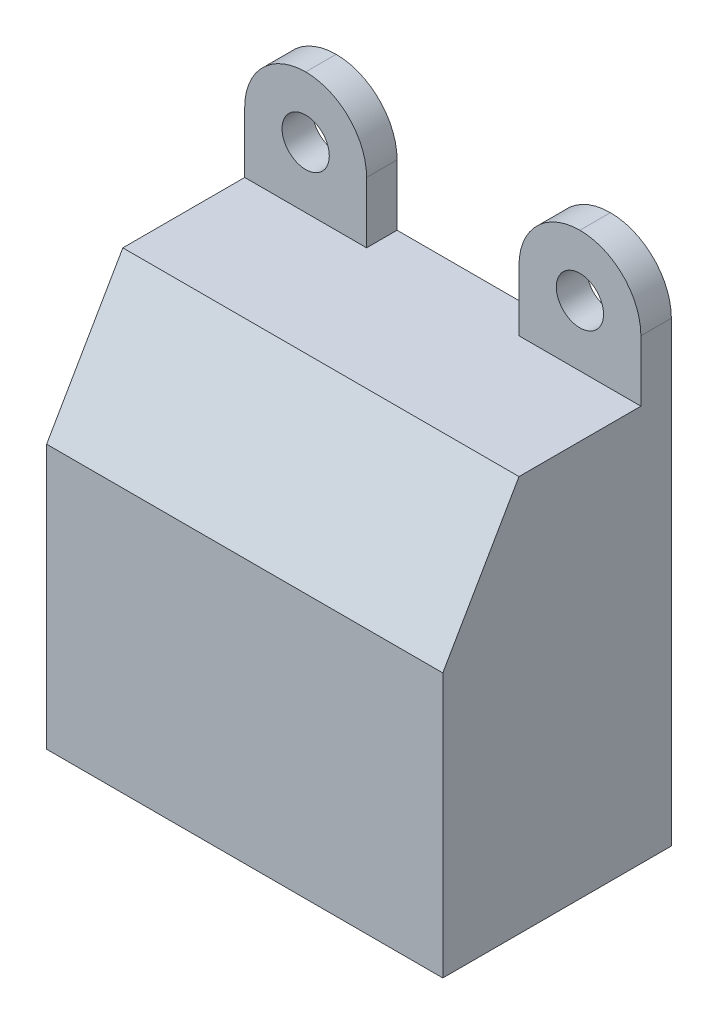
ISO-10303-21;
HEADER;
FILE_DESCRIPTION(('STEP AP214'),'2;1');
FILE_NAME('part.step','',(''),(''),'','','');
FILE_SCHEMA(('AUTOMOTIVE_DESIGN { 1 0 10303 214 1 1 1 1 }'));
ENDSEC;
DATA;
#1=APPLICATION_CONTEXT('core data for automotive mechanical design processes');
#2=APPLICATION_PROTOCOL_DEFINITION('international standard','automotive_design',2000,#1);
#3=PRODUCT_CONTEXT('',#1,'mechanical');
#4=PRODUCT('Part','Part','',(#3));
#5=PRODUCT_RELATED_PRODUCT_CATEGORY('part','',(#4));
#6=PRODUCT_DEFINITION_FORMATION('','',#4);
#7=PRODUCT_DEFINITION_CONTEXT('part definition',#1,'design');
#8=PRODUCT_DEFINITION('design','',#6,#7);
#9=PRODUCT_DEFINITION_SHAPE('','',#8);
#10=(LENGTH_UNIT() NAMED_UNIT(*) SI_UNIT(.MILLI.,.METRE.));
#11=(NAMED_UNIT(*) PLANE_ANGLE_UNIT() SI_UNIT($,.RADIAN.));
#12=(NAMED_UNIT(*) SI_UNIT($,.STERADIAN.) SOLID_ANGLE_UNIT());
#13=UNCERTAINTY_MEASURE_WITH_UNIT(LENGTH_MEASURE(1.E-05),#10,'distance_accuracy_value','');
#14=(GEOMETRIC_REPRESENTATION_CONTEXT(3) GLOBAL_UNCERTAINTY_ASSIGNED_CONTEXT((#13)) GLOBAL_UNIT_ASSIGNED_CONTEXT((#10,
#11,#12)) REPRESENTATION_CONTEXT('',''));
#15=CARTESIAN_POINT('',(0.,0.,0.));
#16=DIRECTION('',(0.,0.,1.));
#17=DIRECTION('',(1.,0.,0.));
#18=AXIS2_PLACEMENT_3D('',#15,#16,#17);
#19=CARTESIAN_POINT('',(70.,26.,15.));
#20=DIRECTION('',(0.,-1.,0.));
#21=DIRECTION('',(1.,0.,0.));
#22=AXIS2_PLACEMENT_3D('',#19,#20,#21);
#23=PLANE('',#22);
#24=DIRECTION('',(0.,0.,1.));
#25=VECTOR('',#24,1.);
#26=CARTESIAN_POINT('',(62.,26.,0.));
#27=LINE('',#26,#25);
#28=CARTESIAN_POINT('',(62.,26.,0.));
#29=VERTEX_POINT('',#28);
#30=CARTESIAN_POINT('',(62.,26.,2.));
#31=VERTEX_POINT('',#30);
#32=EDGE_CURVE('E134',#29,#31,#27,.T.);
#33=ORIENTED_EDGE('',*,*,#32,.F.);
#34=DIRECTION('',(-1.,0.,0.));
#35=VECTOR('',#34,1.);
#36=CARTESIAN_POINT('',(70.,26.,0.));
#37=LINE('',#36,#35);
#38=CARTESIAN_POINT('',(52.,26.,0.));
#39=VERTEX_POINT('',#38);
#40=EDGE_CURVE('E142',#29,#39,#37,.T.);
#41=ORIENTED_EDGE('',*,*,#40,.T.);
#42=DIRECTION('',(0.,0.,-1.));
#43=VECTOR('',#42,1.);
#44=CARTESIAN_POINT('',(52.,26.,0.));
#45=LINE('',#44,#43);
#46=CARTESIAN_POINT('',(52.,26.,2.));
#47=VERTEX_POINT('',#46);
#48=EDGE_CURVE('E172',#47,#39,#45,.T.);
#49=ORIENTED_EDGE('',*,*,#48,.F.);
#50=DIRECTION('',(1.,0.,0.));
#51=VECTOR('',#50,1.);
#52=CARTESIAN_POINT('',(44.,26.,2.));
#53=LINE('',#52,#51);
#54=CARTESIAN_POINT('',(44.,26.,2.));
#55=VERTEX_POINT('',#54);
#56=EDGE_CURVE('E138',#55,#47,#53,.T.);
#57=ORIENTED_EDGE('',*,*,#56,.F.);
#58=DIRECTION('',(0.,0.,-1.));
#59=VECTOR('',#58,1.);
#60=CARTESIAN_POINT('',(44.,26.,15.));
#61=LINE('',#60,#59);
#62=CARTESIAN_POINT('',(44.,26.,9.99999999999999));
#63=VERTEX_POINT('',#62);
#64=EDGE_CURVE('E223',#63,#55,#61,.T.);
#65=ORIENTED_EDGE('',*,*,#64,.F.);
#66=DIRECTION('',(1.,0.,0.));
#67=VECTOR('',#66,1.);
#68=CARTESIAN_POINT('',(70.,26.,9.99999999999999));
#69=LINE('',#68,#67);
#70=CARTESIAN_POINT('',(70.,26.,9.99999999999999));
#71=VERTEX_POINT('',#70);
#72=EDGE_CURVE('E245',#63,#71,#69,.T.);
#73=ORIENTED_EDGE('',*,*,#72,.T.);
#74=DIRECTION('',(0.,0.,-1.));
#75=VECTOR('',#74,1.);
#76=CARTESIAN_POINT('',(70.,26.,15.));
#77=LINE('',#76,#75);
#78=CARTESIAN_POINT('',(70.,26.,2.));
#79=VERTEX_POINT('',#78);
#80=EDGE_CURVE('E226',#71,#79,#77,.T.);
#81=ORIENTED_EDGE('',*,*,#80,.T.);
#82=DIRECTION('',(1.,0.,0.));
#83=VECTOR('',#82,1.);
#84=CARTESIAN_POINT('',(70.,26.,2.));
#85=LINE('',#84,#83);
#86=EDGE_CURVE('E155',#31,#79,#85,.T.);
#87=ORIENTED_EDGE('',*,*,#86,.F.);
#88=EDGE_LOOP('',(#33,#41,#49,#57,#65,#73,#81,#87));
#89=FACE_BOUND('',#88,.T.);
#90=ADVANCED_FACE('F32',(#89),#23,.F.);
#91=CARTESIAN_POINT('',(70.,0.,15.));
#92=DIRECTION('',(-1.,0.,0.));
#93=DIRECTION('',(0.,0.,1.));
#94=AXIS2_PLACEMENT_3D('',#91,#92,#93);
#95=PLANE('',#94);
#96=DIRECTION('',(0.,1.,0.));
#97=VECTOR('',#96,1.);
#98=CARTESIAN_POINT('',(70.,0.,0.));
#99=LINE('',#98,#97);
#100=CARTESIAN_POINT('',(70.,0.,0.));
#101=VERTEX_POINT('',#100);
#102=CARTESIAN_POINT('',(70.,30.,0.));
#103=VERTEX_POINT('',#102);
#104=EDGE_CURVE('E150',#101,#103,#99,.T.);
#105=ORIENTED_EDGE('',*,*,#104,.T.);
#106=DIRECTION('',(0.,0.,-1.));
#107=VECTOR('',#106,1.);
#108=CARTESIAN_POINT('',(70.,30.,15.));
#109=LINE('',#108,#107);
#110=CARTESIAN_POINT('',(70.,30.,2.));
#111=VERTEX_POINT('',#110);
#112=EDGE_CURVE('E192',#103,#111,#109,.F.);
#113=ORIENTED_EDGE('',*,*,#112,.T.);
#114=DIRECTION('',(0.,-1.,0.));
#115=VECTOR('',#114,1.);
#116=CARTESIAN_POINT('',(70.,34.,2.));
#117=LINE('',#116,#115);
#118=EDGE_CURVE('E158',#111,#79,#117,.T.);
#119=ORIENTED_EDGE('',*,*,#118,.T.);
#120=ORIENTED_EDGE('',*,*,#80,.F.);
#121=DIRECTION('',(0.,-0.866025403784438,0.500000000000001));
#122=VECTOR('',#121,1.);
#123=CARTESIAN_POINT('',(70.,17.3397459621556,15.));
#124=LINE('',#123,#122);
#125=CARTESIAN_POINT('',(70.,17.3397459621556,15.));
#126=VERTEX_POINT('',#125);
#127=EDGE_CURVE('E231',#71,#126,#124,.T.);
#128=ORIENTED_EDGE('',*,*,#127,.T.);
#129=DIRECTION('',(0.,1.,0.));
#130=VECTOR('',#129,1.);
#131=CARTESIAN_POINT('',(70.,0.,15.));
#132=LINE('',#131,#130);
#133=CARTESIAN_POINT('',(70.,0.,15.));
#134=VERTEX_POINT('',#133);
#135=EDGE_CURVE('E212',#134,#126,#132,.T.);
#136=ORIENTED_EDGE('',*,*,#135,.F.);
#137=DIRECTION('',(0.,0.,-1.));
#138=VECTOR('',#137,1.);
#139=CARTESIAN_POINT('',(70.,0.,15.));
#140=LINE('',#139,#138);
#141=EDGE_CURVE('E217',#134,#101,#140,.T.);
#142=ORIENTED_EDGE('',*,*,#141,.T.);
#143=EDGE_LOOP('',(#105,#113,#119,#120,#128,#136,#142));
#144=FACE_BOUND('',#143,.T.);
#145=ADVANCED_FACE('F265',(#144),#95,.F.);
#146=CARTESIAN_POINT('',(44.,0.,15.));
#147=DIRECTION('',(1.,0.,0.));
#148=DIRECTION('',(0.,0.,-1.));
#149=AXIS2_PLACEMENT_3D('',#146,#147,#148);
#150=PLANE('',#149);
#151=DIRECTION('',(0.,-1.,0.));
#152=VECTOR('',#151,1.);
#153=CARTESIAN_POINT('',(44.,34.,2.));
#154=LINE('',#153,#152);
#155=CARTESIAN_POINT('',(44.,30.,2.));
#156=VERTEX_POINT('',#155);
#157=EDGE_CURVE('E194',#156,#55,#154,.T.);
#158=ORIENTED_EDGE('',*,*,#157,.F.);
#159=DIRECTION('',(0.,0.,1.));
#160=VECTOR('',#159,1.);
#161=CARTESIAN_POINT('',(44.,30.,0.));
#162=LINE('',#161,#160);
#163=CARTESIAN_POINT('',(44.,30.,0.));
#164=VERTEX_POINT('',#163);
#165=EDGE_CURVE('E41',#156,#164,#162,.F.);
#166=ORIENTED_EDGE('',*,*,#165,.T.);
#167=DIRECTION('',(0.,-1.,0.));
#168=VECTOR('',#167,1.);
#169=CARTESIAN_POINT('',(44.,0.,0.));
#170=LINE('',#169,#168);
#171=CARTESIAN_POINT('',(44.,0.,0.));
#172=VERTEX_POINT('',#171);
#173=EDGE_CURVE('E149',#164,#172,#170,.T.);
#174=ORIENTED_EDGE('',*,*,#173,.T.);
#175=DIRECTION('',(0.,0.,-1.));
#176=VECTOR('',#175,1.);
#177=CARTESIAN_POINT('',(44.,0.,15.));
#178=LINE('',#177,#176);
#179=CARTESIAN_POINT('',(44.,0.,15.));
#180=VERTEX_POINT('',#179);
#181=EDGE_CURVE('E220',#180,#172,#178,.T.);
#182=ORIENTED_EDGE('',*,*,#181,.F.);
#183=DIRECTION('',(0.,-1.,0.));
#184=VECTOR('',#183,1.);
#185=CARTESIAN_POINT('',(44.,0.,15.));
#186=LINE('',#185,#184);
#187=CARTESIAN_POINT('',(44.,17.3397459621556,15.));
#188=VERTEX_POINT('',#187);
#189=EDGE_CURVE('E241',#188,#180,#186,.T.);
#190=ORIENTED_EDGE('',*,*,#189,.F.);
#191=DIRECTION('',(0.,0.866025403784438,-0.500000000000001));
#192=VECTOR('',#191,1.);
#193=CARTESIAN_POINT('',(44.,17.3397459621556,15.));
#194=LINE('',#193,#192);
#195=EDGE_CURVE('E240',#188,#63,#194,.T.);
#196=ORIENTED_EDGE('',*,*,#195,.T.);
#197=ORIENTED_EDGE('',*,*,#64,.T.);
#198=EDGE_LOOP('',(#158,#166,#174,#182,#190,#196,#197));
#199=FACE_BOUND('',#198,.T.);
#200=ADVANCED_FACE('F202',(#199),#150,.F.);
#201=CARTESIAN_POINT('',(70.,0.,15.));
#202=DIRECTION('',(0.,1.,0.));
#203=DIRECTION('',(-1.,0.,0.));
#204=AXIS2_PLACEMENT_3D('',#201,#202,#203);
#205=PLANE('',#204);
#206=DIRECTION('',(1.,0.,0.));
#207=VECTOR('',#206,1.);
#208=CARTESIAN_POINT('',(70.,0.,0.));
#209=LINE('',#208,#207);
#210=EDGE_CURVE('E210',#172,#101,#209,.T.);
#211=ORIENTED_EDGE('',*,*,#210,.T.);
#212=ORIENTED_EDGE('',*,*,#141,.F.);
#213=DIRECTION('',(1.,0.,0.));
#214=VECTOR('',#213,1.);
#215=CARTESIAN_POINT('',(70.,0.,15.));
#216=LINE('',#215,#214);
#217=EDGE_CURVE('E221',#180,#134,#216,.T.);
#218=ORIENTED_EDGE('',*,*,#217,.F.);
#219=ORIENTED_EDGE('',*,*,#181,.T.);
#220=EDGE_LOOP('',(#211,#212,#218,#219));
#221=FACE_BOUND('',#220,.T.);
#222=ADVANCED_FACE('F291',(#221),#205,.F.);
#223=CARTESIAN_POINT('',(0.,0.,15.));
#224=DIRECTION('',(0.,0.,1.));
#225=DIRECTION('',(1.,0.,0.));
#226=AXIS2_PLACEMENT_3D('',#223,#224,#225);
#227=PLANE('',#226);
#228=ORIENTED_EDGE('',*,*,#135,.T.);
#229=DIRECTION('',(-1.,0.,0.));
#230=VECTOR('',#229,1.);
#231=CARTESIAN_POINT('',(44.,17.3397459621556,15.));
#232=LINE('',#231,#230);
#233=EDGE_CURVE('E246',#126,#188,#232,.T.);
#234=ORIENTED_EDGE('',*,*,#233,.T.);
#235=ORIENTED_EDGE('',*,*,#189,.T.);
#236=ORIENTED_EDGE('',*,*,#217,.T.);
#237=EDGE_LOOP('',(#228,#234,#235,#236));
#238=FACE_BOUND('',#237,.T.);
#239=ADVANCED_FACE('F266',(#238),#227,.T.);
#240=CARTESIAN_POINT('',(0.,0.,0.));
#241=DIRECTION('',(0.,0.,1.));
#242=DIRECTION('',(1.,0.,0.));
#243=AXIS2_PLACEMENT_3D('',#240,#241,#242);
#244=PLANE('',#243);
#245=CARTESIAN_POINT('',(48.,30.,0.));
#246=DIRECTION('',(0.,0.,1.));
#247=DIRECTION('',(1.,0.,0.));
#248=AXIS2_PLACEMENT_3D('',#245,#246,#247);
#249=CIRCLE('',#248,1.55);
#250=CARTESIAN_POINT('',(49.55,30.,0.));
#251=VERTEX_POINT('',#250);
#252=EDGE_CURVE('E322',#251,#251,#249,.F.);
#253=ORIENTED_EDGE('',*,*,#252,.F.);
#254=EDGE_LOOP('',(#253));
#255=FACE_BOUND('',#254,.T.);
#256=CARTESIAN_POINT('',(66.,30.,0.));
#257=DIRECTION('',(0.,0.,1.));
#258=DIRECTION('',(1.,0.,0.));
#259=AXIS2_PLACEMENT_3D('',#256,#257,#258);
#260=CIRCLE('',#259,1.55000000000001);
#261=CARTESIAN_POINT('',(67.55,30.,0.));
#262=VERTEX_POINT('',#261);
#263=EDGE_CURVE('E162',#262,#262,#260,.F.);
#264=ORIENTED_EDGE('',*,*,#263,.F.);
#265=EDGE_LOOP('',(#264));
#266=FACE_BOUND('',#265,.T.);
#267=DIRECTION('',(0.,-1.,0.));
#268=VECTOR('',#267,1.);
#269=CARTESIAN_POINT('',(62.,34.,0.));
#270=LINE('',#269,#268);
#271=CARTESIAN_POINT('',(62.,30.,0.));
#272=VERTEX_POINT('',#271);
#273=EDGE_CURVE('E129',#272,#29,#270,.T.);
#274=ORIENTED_EDGE('',*,*,#273,.F.);
#275=CARTESIAN_POINT('',(66.,30.,0.));
#276=DIRECTION('',(0.,0.,1.));
#277=DIRECTION('',(1.,0.,0.));
#278=AXIS2_PLACEMENT_3D('',#275,#276,#277);
#279=CIRCLE('',#278,4.);
#280=CARTESIAN_POINT('',(66.,34.,0.));
#281=VERTEX_POINT('',#280);
#282=EDGE_CURVE('E190',#272,#281,#279,.F.);
#283=ORIENTED_EDGE('',*,*,#282,.T.);
#284=CARTESIAN_POINT('',(66.,30.,0.));
#285=DIRECTION('',(0.,0.,1.));
#286=DIRECTION('',(1.,0.,0.));
#287=AXIS2_PLACEMENT_3D('',#284,#285,#286);
#288=CIRCLE('',#287,4.);
#289=EDGE_CURVE('E188',#281,#103,#288,.F.);
#290=ORIENTED_EDGE('',*,*,#289,.T.);
#291=ORIENTED_EDGE('',*,*,#104,.F.);
#292=ORIENTED_EDGE('',*,*,#210,.F.);
#293=ORIENTED_EDGE('',*,*,#173,.F.);
#294=CARTESIAN_POINT('',(48.,30.,0.));
#295=DIRECTION('',(0.,0.,1.));
#296=DIRECTION('',(1.,0.,0.));
#297=AXIS2_PLACEMENT_3D('',#294,#295,#296);
#298=CIRCLE('',#297,4.);
#299=CARTESIAN_POINT('',(48.,34.,0.));
#300=VERTEX_POINT('',#299);
#301=EDGE_CURVE('E186',#164,#300,#298,.F.);
#302=ORIENTED_EDGE('',*,*,#301,.T.);
#303=CARTESIAN_POINT('',(48.,30.,0.));
#304=DIRECTION('',(0.,0.,1.));
#305=DIRECTION('',(1.,0.,0.));
#306=AXIS2_PLACEMENT_3D('',#303,#304,#305);
#307=CIRCLE('',#306,4.);
#308=CARTESIAN_POINT('',(52.,30.,0.));
#309=VERTEX_POINT('',#308);
#310=EDGE_CURVE('E184',#300,#309,#307,.F.);
#311=ORIENTED_EDGE('',*,*,#310,.T.);
#312=DIRECTION('',(0.,-1.,0.));
#313=VECTOR('',#312,1.);
#314=CARTESIAN_POINT('',(52.,34.,0.));
#315=LINE('',#314,#313);
#316=EDGE_CURVE('E145',#309,#39,#315,.T.);
#317=ORIENTED_EDGE('',*,*,#316,.T.);
#318=ORIENTED_EDGE('',*,*,#40,.F.);
#319=EDGE_LOOP('',(#274,#283,#290,#291,#292,#293,#302,#311,#317,#318));
#320=FACE_BOUND('',#319,.T.);
#321=ADVANCED_FACE('F143',(#255,#266,#320),#244,.F.);
#322=CARTESIAN_POINT('',(0.,17.3397459621556,15.));
#323=DIRECTION('',(0.,0.500000000000001,0.866025403784438));
#324=DIRECTION('',(1.,0.,0.));
#325=AXIS2_PLACEMENT_3D('',#322,#323,#324);
#326=PLANE('',#325);
#327=ORIENTED_EDGE('',*,*,#127,.F.);
#328=ORIENTED_EDGE('',*,*,#72,.F.);
#329=ORIENTED_EDGE('',*,*,#195,.F.);
#330=ORIENTED_EDGE('',*,*,#233,.F.);
#331=EDGE_LOOP('',(#327,#328,#329,#330));
#332=FACE_BOUND('',#331,.T.);
#333=ADVANCED_FACE('F269',(#332),#326,.T.);
#334=CARTESIAN_POINT('',(44.,34.,2.));
#335=DIRECTION('',(0.,0.,-1.));
#336=DIRECTION('',(-1.,0.,0.));
#337=AXIS2_PLACEMENT_3D('',#334,#335,#336);
#338=PLANE('',#337);
#339=CARTESIAN_POINT('',(48.,30.,2.));
#340=DIRECTION('',(0.,0.,1.));
#341=DIRECTION('',(1.,0.,0.));
#342=AXIS2_PLACEMENT_3D('',#339,#340,#341);
#343=CIRCLE('',#342,1.55);
#344=CARTESIAN_POINT('',(49.55,30.,2.));
#345=VERTEX_POINT('',#344);
#346=EDGE_CURVE('E319',#345,#345,#343,.T.);
#347=ORIENTED_EDGE('',*,*,#346,.F.);
#348=EDGE_LOOP('',(#347));
#349=FACE_BOUND('',#348,.T.);
#350=CARTESIAN_POINT('',(48.,30.,2.));
#351=DIRECTION('',(0.,0.,-1.));
#352=DIRECTION('',(-1.,0.,0.));
#353=AXIS2_PLACEMENT_3D('',#350,#351,#352);
#354=CIRCLE('',#353,4.);
#355=CARTESIAN_POINT('',(52.,30.,2.));
#356=VERTEX_POINT('',#355);
#357=CARTESIAN_POINT('',(48.,34.,2.));
#358=VERTEX_POINT('',#357);
#359=EDGE_CURVE('E54',#356,#358,#354,.F.);
#360=ORIENTED_EDGE('',*,*,#359,.T.);
#361=CARTESIAN_POINT('',(48.,30.,2.));
#362=DIRECTION('',(0.,0.,-1.));
#363=DIRECTION('',(-1.,0.,0.));
#364=AXIS2_PLACEMENT_3D('',#361,#362,#363);
#365=CIRCLE('',#364,4.);
#366=EDGE_CURVE('E49',#358,#156,#365,.F.);
#367=ORIENTED_EDGE('',*,*,#366,.T.);
#368=ORIENTED_EDGE('',*,*,#157,.T.);
#369=ORIENTED_EDGE('',*,*,#56,.T.);
#370=DIRECTION('',(0.,-1.,0.));
#371=VECTOR('',#370,1.);
#372=CARTESIAN_POINT('',(52.,34.,2.));
#373=LINE('',#372,#371);
#374=EDGE_CURVE('E169',#356,#47,#373,.T.);
#375=ORIENTED_EDGE('',*,*,#374,.F.);
#376=EDGE_LOOP('',(#360,#367,#368,#369,#375));
#377=FACE_BOUND('',#376,.T.);
#378=ADVANCED_FACE('F236',(#349,#377),#338,.F.);
#379=CARTESIAN_POINT('',(52.,34.,0.));
#380=DIRECTION('',(-1.,0.,0.));
#381=DIRECTION('',(0.,-1.,0.));
#382=AXIS2_PLACEMENT_3D('',#379,#380,#381);
#383=PLANE('',#382);
#384=ORIENTED_EDGE('',*,*,#316,.F.);
#385=DIRECTION('',(0.,0.,-1.));
#386=VECTOR('',#385,1.);
#387=CARTESIAN_POINT('',(52.,30.,2.));
#388=LINE('',#387,#386);
#389=EDGE_CURVE('E11',#309,#356,#388,.F.);
#390=ORIENTED_EDGE('',*,*,#389,.T.);
#391=ORIENTED_EDGE('',*,*,#374,.T.);
#392=ORIENTED_EDGE('',*,*,#48,.T.);
#393=EDGE_LOOP('',(#384,#390,#391,#392));
#394=FACE_BOUND('',#393,.T.);
#395=ADVANCED_FACE('F276',(#394),#383,.F.);
#396=CARTESIAN_POINT('',(62.,34.,0.));
#397=DIRECTION('',(1.,0.,0.));
#398=DIRECTION('',(0.,1.,0.));
#399=AXIS2_PLACEMENT_3D('',#396,#397,#398);
#400=PLANE('',#399);
#401=DIRECTION('',(0.,-1.,0.));
#402=VECTOR('',#401,1.);
#403=CARTESIAN_POINT('',(62.,34.,2.));
#404=LINE('',#403,#402);
#405=CARTESIAN_POINT('',(62.,30.,2.));
#406=VERTEX_POINT('',#405);
#407=EDGE_CURVE('E139',#406,#31,#404,.T.);
#408=ORIENTED_EDGE('',*,*,#407,.F.);
#409=DIRECTION('',(0.,0.,1.));
#410=VECTOR('',#409,1.);
#411=CARTESIAN_POINT('',(62.,30.,0.));
#412=LINE('',#411,#410);
#413=EDGE_CURVE('E136',#406,#272,#412,.F.);
#414=ORIENTED_EDGE('',*,*,#413,.T.);
#415=ORIENTED_EDGE('',*,*,#273,.T.);
#416=ORIENTED_EDGE('',*,*,#32,.T.);
#417=EDGE_LOOP('',(#408,#414,#415,#416));
#418=FACE_BOUND('',#417,.T.);
#419=ADVANCED_FACE('F132',(#418),#400,.F.);
#420=CARTESIAN_POINT('',(70.,34.,2.));
#421=DIRECTION('',(0.,0.,-1.));
#422=DIRECTION('',(-1.,0.,0.));
#423=AXIS2_PLACEMENT_3D('',#420,#421,#422);
#424=PLANE('',#423);
#425=CARTESIAN_POINT('',(66.,30.,2.));
#426=DIRECTION('',(0.,0.,1.));
#427=DIRECTION('',(1.,0.,0.));
#428=AXIS2_PLACEMENT_3D('',#425,#426,#427);
#429=CIRCLE('',#428,1.55000000000001);
#430=CARTESIAN_POINT('',(67.55,30.,2.));
#431=VERTEX_POINT('',#430);
#432=EDGE_CURVE('E323',#431,#431,#429,.T.);
#433=ORIENTED_EDGE('',*,*,#432,.F.);
#434=EDGE_LOOP('',(#433));
#435=FACE_BOUND('',#434,.T.);
#436=CARTESIAN_POINT('',(66.,30.,2.));
#437=DIRECTION('',(0.,0.,-1.));
#438=DIRECTION('',(-1.,0.,0.));
#439=AXIS2_PLACEMENT_3D('',#436,#437,#438);
#440=CIRCLE('',#439,4.);
#441=CARTESIAN_POINT('',(66.,34.,2.));
#442=VERTEX_POINT('',#441);
#443=EDGE_CURVE('E261',#111,#442,#440,.F.);
#444=ORIENTED_EDGE('',*,*,#443,.T.);
#445=CARTESIAN_POINT('',(66.,30.,2.));
#446=DIRECTION('',(0.,0.,-1.));
#447=DIRECTION('',(-1.,0.,0.));
#448=AXIS2_PLACEMENT_3D('',#445,#446,#447);
#449=CIRCLE('',#448,4.);
#450=EDGE_CURVE('E258',#442,#406,#449,.F.);
#451=ORIENTED_EDGE('',*,*,#450,.T.);
#452=ORIENTED_EDGE('',*,*,#407,.T.);
#453=ORIENTED_EDGE('',*,*,#86,.T.);
#454=ORIENTED_EDGE('',*,*,#118,.F.);
#455=EDGE_LOOP('',(#444,#451,#452,#453,#454));
#456=FACE_BOUND('',#455,.T.);
#457=ADVANCED_FACE('F255',(#435,#456),#424,.F.);
#458=CARTESIAN_POINT('',(66.,30.,0.));
#459=DIRECTION('',(0.,0.,-1.));
#460=DIRECTION('',(-1.,0.,0.));
#461=AXIS2_PLACEMENT_3D('',#458,#459,#460);
#462=CYLINDRICAL_SURFACE('',#461,4.);
#463=ORIENTED_EDGE('',*,*,#112,.F.);
#464=ORIENTED_EDGE('',*,*,#289,.F.);
#465=DIRECTION('',(0.,0.,-1.));
#466=VECTOR('',#465,1.);
#467=CARTESIAN_POINT('',(66.,34.,0.));
#468=LINE('',#467,#466);
#469=EDGE_CURVE('E156',#442,#281,#468,.T.);
#470=ORIENTED_EDGE('',*,*,#469,.F.);
#471=ORIENTED_EDGE('',*,*,#443,.F.);
#472=EDGE_LOOP('',(#463,#464,#470,#471));
#473=FACE_BOUND('',#472,.T.);
#474=ADVANCED_FACE('F304',(#473),#462,.T.);
#475=CARTESIAN_POINT('',(66.,30.,0.));
#476=DIRECTION('',(0.,0.,1.));
#477=DIRECTION('',(1.,0.,0.));
#478=AXIS2_PLACEMENT_3D('',#475,#476,#477);
#479=CYLINDRICAL_SURFACE('',#478,4.);
#480=ORIENTED_EDGE('',*,*,#282,.F.);
#481=ORIENTED_EDGE('',*,*,#413,.F.);
#482=ORIENTED_EDGE('',*,*,#450,.F.);
#483=ORIENTED_EDGE('',*,*,#469,.T.);
#484=EDGE_LOOP('',(#480,#481,#482,#483));
#485=FACE_BOUND('',#484,.T.);
#486=ADVANCED_FACE('F260',(#485),#479,.T.);
#487=CARTESIAN_POINT('',(48.,30.,0.));
#488=DIRECTION('',(0.,0.,1.));
#489=DIRECTION('',(1.,0.,0.));
#490=AXIS2_PLACEMENT_3D('',#487,#488,#489);
#491=CYLINDRICAL_SURFACE('',#490,4.);
#492=ORIENTED_EDGE('',*,*,#389,.F.);
#493=ORIENTED_EDGE('',*,*,#310,.F.);
#494=DIRECTION('',(0.,0.,-1.));
#495=VECTOR('',#494,1.);
#496=CARTESIAN_POINT('',(48.,34.,0.));
#497=LINE('',#496,#495);
#498=EDGE_CURVE('E36',#358,#300,#497,.T.);
#499=ORIENTED_EDGE('',*,*,#498,.F.);
#500=ORIENTED_EDGE('',*,*,#359,.F.);
#501=EDGE_LOOP('',(#492,#493,#499,#500));
#502=FACE_BOUND('',#501,.T.);
#503=ADVANCED_FACE('F34',(#502),#491,.T.);
#504=CARTESIAN_POINT('',(48.,30.,0.));
#505=DIRECTION('',(0.,0.,-1.));
#506=DIRECTION('',(-1.,0.,0.));
#507=AXIS2_PLACEMENT_3D('',#504,#505,#506);
#508=CYLINDRICAL_SURFACE('',#507,4.);
#509=ORIENTED_EDGE('',*,*,#301,.F.);
#510=ORIENTED_EDGE('',*,*,#165,.F.);
#511=ORIENTED_EDGE('',*,*,#366,.F.);
#512=ORIENTED_EDGE('',*,*,#498,.T.);
#513=EDGE_LOOP('',(#509,#510,#511,#512));
#514=FACE_BOUND('',#513,.T.);
#515=ADVANCED_FACE('F310',(#514),#508,.T.);
#516=CARTESIAN_POINT('',(66.,30.,-0.00104999999999984));
#517=DIRECTION('',(0.,0.,1.));
#518=DIRECTION('',(1.,0.,0.));
#519=AXIS2_PLACEMENT_3D('',#516,#517,#518);
#520=CYLINDRICAL_SURFACE('',#519,1.55000000000001);
#521=ORIENTED_EDGE('',*,*,#432,.T.);
#522=EDGE_LOOP('',(#521));
#523=FACE_BOUND('',#522,.T.);
#524=ORIENTED_EDGE('',*,*,#263,.T.);
#525=EDGE_LOOP('',(#524));
#526=FACE_BOUND('',#525,.T.);
#527=ADVANCED_FACE('F306',(#523,#526),#520,.F.);
#528=CARTESIAN_POINT('',(48.,30.,-0.00104999999999984));
#529=DIRECTION('',(0.,0.,1.));
#530=DIRECTION('',(1.,0.,0.));
#531=AXIS2_PLACEMENT_3D('',#528,#529,#530);
#532=CYLINDRICAL_SURFACE('',#531,1.55);
#533=ORIENTED_EDGE('',*,*,#346,.T.);
#534=EDGE_LOOP('',(#533));
#535=FACE_BOUND('',#534,.T.);
#536=ORIENTED_EDGE('',*,*,#252,.T.);
#537=EDGE_LOOP('',(#536));
#538=FACE_BOUND('',#537,.T.);
#539=ADVANCED_FACE('F309',(#535,#538),#532,.F.);
#540=CLOSED_SHELL('',(#90,#145,#200,#222,#239,#321,#333,#378,#395,#419,#457,#474,#486,#503,#515,
#527,#539));
#541=MANIFOLD_SOLID_BREP('B2',#540);
#542=ADVANCED_BREP_SHAPE_REPRESENTATION('',(#18,#541),#14);
#543=SHAPE_DEFINITION_REPRESENTATION(#9,#542);
ENDSEC;
END-ISO-10303-21;
